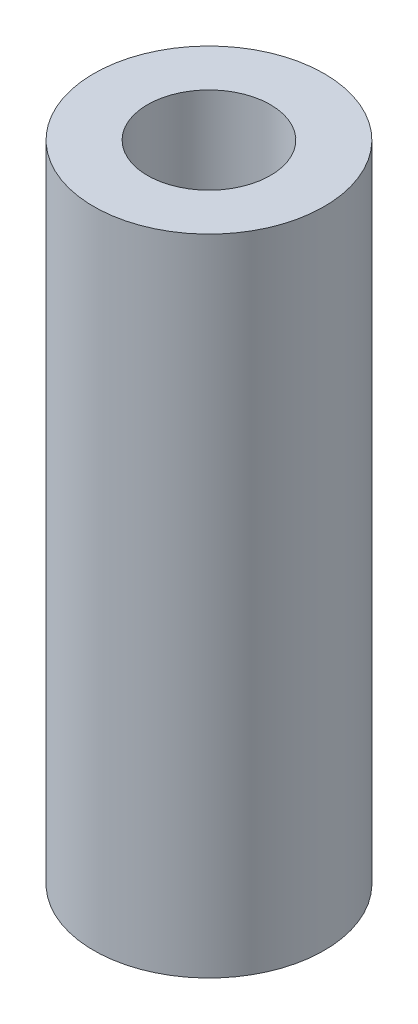
ISO-10303-21;
HEADER;
FILE_DESCRIPTION(('STEP AP214'),'2;1');
FILE_NAME('part.step','',(''),(''),'','','');
FILE_SCHEMA(('AUTOMOTIVE_DESIGN { 1 0 10303 214 1 1 1 1 }'));
ENDSEC;
DATA;
#1=APPLICATION_CONTEXT('core data for automotive mechanical design processes');
#2=APPLICATION_PROTOCOL_DEFINITION('international standard','automotive_design',2000,#1);
#3=PRODUCT_CONTEXT('',#1,'mechanical');
#4=PRODUCT('Part','Part','',(#3));
#5=PRODUCT_RELATED_PRODUCT_CATEGORY('part','',(#4));
#6=PRODUCT_DEFINITION_FORMATION('','',#4);
#7=PRODUCT_DEFINITION_CONTEXT('part definition',#1,'design');
#8=PRODUCT_DEFINITION('design','',#6,#7);
#9=PRODUCT_DEFINITION_SHAPE('','',#8);
#10=(LENGTH_UNIT() NAMED_UNIT(*) SI_UNIT(.MILLI.,.METRE.));
#11=(NAMED_UNIT(*) PLANE_ANGLE_UNIT() SI_UNIT($,.RADIAN.));
#12=(NAMED_UNIT(*) SI_UNIT($,.STERADIAN.) SOLID_ANGLE_UNIT());
#13=UNCERTAINTY_MEASURE_WITH_UNIT(LENGTH_MEASURE(1.E-05),#10,'distance_accuracy_value','');
#14=(GEOMETRIC_REPRESENTATION_CONTEXT(3) GLOBAL_UNCERTAINTY_ASSIGNED_CONTEXT((#13)) GLOBAL_UNIT_ASSIGNED_CONTEXT((#10,
#11,#12)) REPRESENTATION_CONTEXT('',''));
#15=CARTESIAN_POINT('',(0.,0.,0.));
#16=DIRECTION('',(0.,0.,1.));
#17=DIRECTION('',(1.,0.,0.));
#18=AXIS2_PLACEMENT_3D('',#15,#16,#17);
#19=CARTESIAN_POINT('',(0.,0.,0.));
#20=DIRECTION('',(0.,1.,0.));
#21=DIRECTION('',(0.,0.,1.));
#22=AXIS2_PLACEMENT_3D('',#19,#20,#21);
#23=PLANE('',#22);
#24=CARTESIAN_POINT('',(0.,0.,0.));
#25=DIRECTION('',(0.,-1.,0.));
#26=DIRECTION('',(0.,0.,-1.));
#27=AXIS2_PLACEMENT_3D('',#24,#25,#26);
#28=CIRCLE('',#27,7.5);
#29=CARTESIAN_POINT('',(0.,0.,-7.5));
#30=VERTEX_POINT('',#29);
#31=EDGE_CURVE('E10',#30,#30,#28,.T.);
#32=ORIENTED_EDGE('',*,*,#31,.T.);
#33=EDGE_LOOP('',(#32));
#34=FACE_BOUND('',#33,.T.);
#35=ADVANCED_FACE('F31',(#34),#23,.F.);
#36=CARTESIAN_POINT('',(0.,-2.34500129810616,0.));
#37=DIRECTION('',(0.,-1.,0.));
#38=DIRECTION('',(0.,0.,-1.));
#39=AXIS2_PLACEMENT_3D('',#36,#37,#38);
#40=CYLINDRICAL_SURFACE('',#39,7.5);
#41=ORIENTED_EDGE('',*,*,#31,.F.);
#42=EDGE_LOOP('',(#41));
#43=FACE_BOUND('',#42,.T.);
#44=CARTESIAN_POINT('',(0.,41.9367802108678,0.));
#45=DIRECTION('',(0.,-1.,0.));
#46=DIRECTION('',(0.,0.,-1.));
#47=AXIS2_PLACEMENT_3D('',#44,#45,#46);
#48=CIRCLE('',#47,7.5);
#49=CARTESIAN_POINT('',(0.,41.9367802108678,-7.5));
#50=VERTEX_POINT('',#49);
#51=EDGE_CURVE('E37',#50,#50,#48,.T.);
#52=ORIENTED_EDGE('',*,*,#51,.T.);
#53=EDGE_LOOP('',(#52));
#54=FACE_BOUND('',#53,.T.);
#55=ADVANCED_FACE('F63',(#43,#54),#40,.T.);
#56=CARTESIAN_POINT('',(-7.5,41.9367802108678,0.));
#57=DIRECTION('',(0.,-1.,0.));
#58=DIRECTION('',(0.,0.,-1.));
#59=AXIS2_PLACEMENT_3D('',#56,#57,#58);
#60=PLANE('',#59);
#61=ORIENTED_EDGE('',*,*,#51,.F.);
#62=EDGE_LOOP('',(#61));
#63=FACE_BOUND('',#62,.T.);
#64=CARTESIAN_POINT('',(0.,41.9367802108678,0.));
#65=DIRECTION('',(0.,-1.,0.));
#66=DIRECTION('',(0.,0.,-1.));
#67=AXIS2_PLACEMENT_3D('',#64,#65,#66);
#68=CIRCLE('',#67,4.);
#69=CARTESIAN_POINT('',(0.,41.9367802108678,-4.));
#70=VERTEX_POINT('',#69);
#71=EDGE_CURVE('E41',#70,#70,#68,.T.);
#72=ORIENTED_EDGE('',*,*,#71,.T.);
#73=EDGE_LOOP('',(#72));
#74=FACE_BOUND('',#73,.T.);
#75=ADVANCED_FACE('F59',(#63,#74),#60,.F.);
#76=CARTESIAN_POINT('',(0.,-2.34500129810616,0.));
#77=DIRECTION('',(0.,-1.,0.));
#78=DIRECTION('',(0.,0.,-1.));
#79=AXIS2_PLACEMENT_3D('',#76,#77,#78);
#80=CYLINDRICAL_SURFACE('',#79,4.);
#81=ORIENTED_EDGE('',*,*,#71,.F.);
#82=EDGE_LOOP('',(#81));
#83=FACE_BOUND('',#82,.T.);
#84=CARTESIAN_POINT('',(0.,18.,0.));
#85=DIRECTION('',(0.,-1.,0.));
#86=DIRECTION('',(0.,0.,-1.));
#87=AXIS2_PLACEMENT_3D('',#84,#85,#86);
#88=CIRCLE('',#87,4.);
#89=CARTESIAN_POINT('',(0.,18.,-4.));
#90=VERTEX_POINT('',#89);
#91=EDGE_CURVE('E45',#90,#90,#88,.T.);
#92=ORIENTED_EDGE('',*,*,#91,.T.);
#93=EDGE_LOOP('',(#92));
#94=FACE_BOUND('',#93,.T.);
#95=ADVANCED_FACE('F51',(#83,#94),#80,.F.);
#96=CARTESIAN_POINT('',(-4.,18.,0.));
#97=DIRECTION('',(0.,-1.,0.));
#98=DIRECTION('',(0.,0.,-1.));
#99=AXIS2_PLACEMENT_3D('',#96,#97,#98);
#100=PLANE('',#99);
#101=ORIENTED_EDGE('',*,*,#91,.F.);
#102=EDGE_LOOP('',(#101));
#103=FACE_BOUND('',#102,.T.);
#104=ADVANCED_FACE('F53',(#103),#100,.F.);
#105=CLOSED_SHELL('',(#35,#55,#75,#95,#104));
#106=MANIFOLD_SOLID_BREP('B2',#105);
#107=ADVANCED_BREP_SHAPE_REPRESENTATION('',(#18,#106),#14);
#108=SHAPE_DEFINITION_REPRESENTATION(#9,#107);
ENDSEC;
END-ISO-10303-21;
